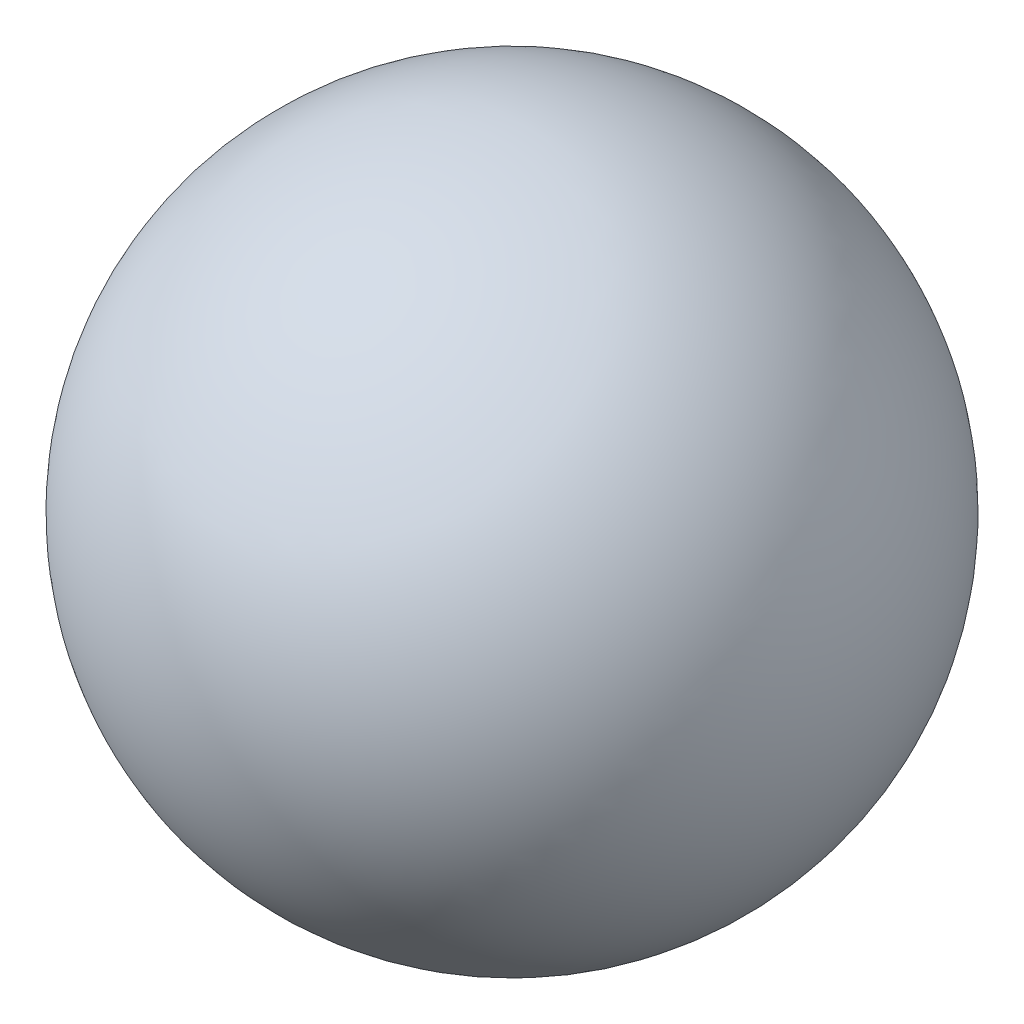
ISO-10303-21;
HEADER;
FILE_DESCRIPTION(('STEP AP214'),'2;1');
FILE_NAME('part.step','',(''),(''),'','','');
FILE_SCHEMA(('AUTOMOTIVE_DESIGN { 1 0 10303 214 1 1 1 1 }'));
ENDSEC;
DATA;
#1=APPLICATION_CONTEXT('core data for automotive mechanical design processes');
#2=APPLICATION_PROTOCOL_DEFINITION('international standard','automotive_design',2000,#1);
#3=PRODUCT_CONTEXT('',#1,'mechanical');
#4=PRODUCT('Part','Part','',(#3));
#5=PRODUCT_RELATED_PRODUCT_CATEGORY('part','',(#4));
#6=PRODUCT_DEFINITION_FORMATION('','',#4);
#7=PRODUCT_DEFINITION_CONTEXT('part definition',#1,'design');
#8=PRODUCT_DEFINITION('design','',#6,#7);
#9=PRODUCT_DEFINITION_SHAPE('','',#8);
#10=(LENGTH_UNIT() NAMED_UNIT(*) SI_UNIT(.MILLI.,.METRE.));
#11=(NAMED_UNIT(*) PLANE_ANGLE_UNIT() SI_UNIT($,.RADIAN.));
#12=(NAMED_UNIT(*) SI_UNIT($,.STERADIAN.) SOLID_ANGLE_UNIT());
#13=UNCERTAINTY_MEASURE_WITH_UNIT(LENGTH_MEASURE(1.E-05),#10,'distance_accuracy_value','');
#14=(GEOMETRIC_REPRESENTATION_CONTEXT(3) GLOBAL_UNCERTAINTY_ASSIGNED_CONTEXT((#13)) GLOBAL_UNIT_ASSIGNED_CONTEXT((#10,
#11,#12)) REPRESENTATION_CONTEXT('',''));
#15=CARTESIAN_POINT('',(0.,0.,0.));
#16=DIRECTION('',(0.,0.,1.));
#17=DIRECTION('',(1.,0.,0.));
#18=AXIS2_PLACEMENT_3D('',#15,#16,#17);
#19=CARTESIAN_POINT('',(9.57126743659143,-2.,6.8156686874616));
#20=DIRECTION('',(0.,0.,1.));
#21=DIRECTION('',(1.,0.,0.));
#22=AXIS2_PLACEMENT_3D('',#19,#20,#21);
#23=SPHERICAL_SURFACE('',#22,1.05);
#24=CARTESIAN_POINT('',(9.57126743659143,-2.,7.8656686874616));
#25=VERTEX_POINT('',#24);
#26=VERTEX_LOOP('',#25);
#27=FACE_BOUND('',#26,.T.);
#28=ADVANCED_FACE('F12',(#27),#23,.T.);
#29=CLOSED_SHELL('',(#28));
#30=MANIFOLD_SOLID_BREP('B1',#29);
#31=ADVANCED_BREP_SHAPE_REPRESENTATION('',(#18,#30),#14);
#32=SHAPE_DEFINITION_REPRESENTATION(#9,#31);
ENDSEC;
END-ISO-10303-21;
